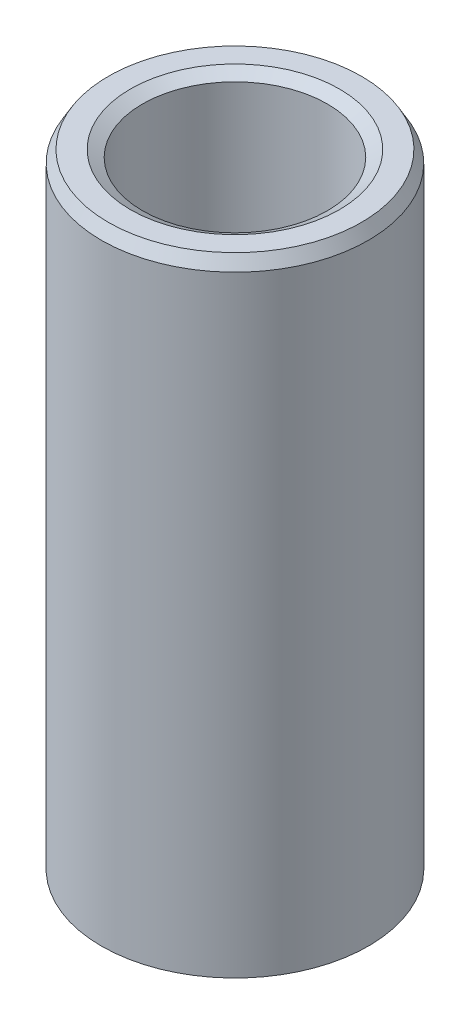
ISO-10303-21;
HEADER;
FILE_DESCRIPTION(('STEP AP214'),'2;1');
FILE_NAME('part.step','',(''),(''),'','','');
FILE_SCHEMA(('AUTOMOTIVE_DESIGN { 1 0 10303 214 1 1 1 1 }'));
ENDSEC;
DATA;
#1=APPLICATION_CONTEXT('core data for automotive mechanical design processes');
#2=APPLICATION_PROTOCOL_DEFINITION('international standard','automotive_design',2000,#1);
#3=PRODUCT_CONTEXT('',#1,'mechanical');
#4=PRODUCT('Part','Part','',(#3));
#5=PRODUCT_RELATED_PRODUCT_CATEGORY('part','',(#4));
#6=PRODUCT_DEFINITION_FORMATION('','',#4);
#7=PRODUCT_DEFINITION_CONTEXT('part definition',#1,'design');
#8=PRODUCT_DEFINITION('design','',#6,#7);
#9=PRODUCT_DEFINITION_SHAPE('','',#8);
#10=(LENGTH_UNIT() NAMED_UNIT(*) SI_UNIT(.MILLI.,.METRE.));
#11=(NAMED_UNIT(*) PLANE_ANGLE_UNIT() SI_UNIT($,.RADIAN.));
#12=(NAMED_UNIT(*) SI_UNIT($,.STERADIAN.) SOLID_ANGLE_UNIT());
#13=UNCERTAINTY_MEASURE_WITH_UNIT(LENGTH_MEASURE(1.E-05),#10,'distance_accuracy_value','');
#14=(GEOMETRIC_REPRESENTATION_CONTEXT(3) GLOBAL_UNCERTAINTY_ASSIGNED_CONTEXT((#13)) GLOBAL_UNIT_ASSIGNED_CONTEXT((#10,
#11,#12)) REPRESENTATION_CONTEXT('',''));
#15=CARTESIAN_POINT('',(0.,0.,0.));
#16=DIRECTION('',(0.,0.,1.));
#17=DIRECTION('',(1.,0.,0.));
#18=AXIS2_PLACEMENT_3D('',#15,#16,#17);
#19=CARTESIAN_POINT('',(0.,70.8002748482251,0.));
#20=DIRECTION('',(0.,-1.,0.));
#21=DIRECTION('',(0.,0.,-1.));
#22=AXIS2_PLACEMENT_3D('',#19,#20,#21);
#23=CYLINDRICAL_SURFACE('',#22,15.);
#24=CARTESIAN_POINT('',(0.,0.780929221135637,0.));
#25=DIRECTION('',(0.,1.,0.));
#26=DIRECTION('',(0.,0.,1.));
#27=AXIS2_PLACEMENT_3D('',#24,#25,#26);
#28=CIRCLE('',#27,15.);
#29=CARTESIAN_POINT('',(0.,0.780929221135637,15.));
#30=VERTEX_POINT('',#29);
#31=EDGE_CURVE('E10',#30,#30,#28,.T.);
#32=ORIENTED_EDGE('',*,*,#31,.T.);
#33=EDGE_LOOP('',(#32));
#34=FACE_BOUND('',#33,.T.);
#35=CARTESIAN_POINT('',(0.,69.447665760103,0.));
#36=DIRECTION('',(0.,1.,0.));
#37=DIRECTION('',(0.,0.,1.));
#38=AXIS2_PLACEMENT_3D('',#35,#36,#37);
#39=CIRCLE('',#38,15.);
#40=CARTESIAN_POINT('',(0.,69.447665760103,15.));
#41=VERTEX_POINT('',#40);
#42=EDGE_CURVE('E50',#41,#41,#39,.F.);
#43=ORIENTED_EDGE('',*,*,#42,.T.);
#44=EDGE_LOOP('',(#43));
#45=FACE_BOUND('',#44,.T.);
#46=ADVANCED_FACE('F39',(#34,#45),#23,.T.);
#47=CARTESIAN_POINT('',(0.,70.8002748482251,0.));
#48=DIRECTION('',(0.,1.,0.));
#49=DIRECTION('',(0.,0.,1.));
#50=AXIS2_PLACEMENT_3D('',#47,#48,#49);
#51=PLANE('',#50);
#52=CARTESIAN_POINT('',(0.,70.8002748482251,0.));
#53=DIRECTION('',(0.,1.,0.));
#54=DIRECTION('',(0.,0.,1.));
#55=AXIS2_PLACEMENT_3D('',#52,#53,#54);
#56=CIRCLE('',#55,11.743660745866);
#57=CARTESIAN_POINT('',(0.,70.8002748482251,11.743660745866));
#58=VERTEX_POINT('',#57);
#59=EDGE_CURVE('E58',#58,#58,#56,.F.);
#60=ORIENTED_EDGE('',*,*,#59,.T.);
#61=EDGE_LOOP('',(#60));
#62=FACE_BOUND('',#61,.T.);
#63=CARTESIAN_POINT('',(0.,70.8002748482251,0.));
#64=DIRECTION('',(0.,1.,0.));
#65=DIRECTION('',(0.,0.,1.));
#66=AXIS2_PLACEMENT_3D('',#63,#64,#65);
#67=CIRCLE('',#66,14.2190707788644);
#68=CARTESIAN_POINT('',(0.,70.8002748482251,14.2190707788644));
#69=VERTEX_POINT('',#68);
#70=EDGE_CURVE('E61',#69,#69,#67,.T.);
#71=ORIENTED_EDGE('',*,*,#70,.T.);
#72=EDGE_LOOP('',(#71));
#73=FACE_BOUND('',#72,.T.);
#74=ADVANCED_FACE('F88',(#62,#73),#51,.T.);
#75=CARTESIAN_POINT('',(0.,0.,0.));
#76=DIRECTION('',(0.,1.,0.));
#77=DIRECTION('',(0.,0.,1.));
#78=AXIS2_PLACEMENT_3D('',#75,#76,#77);
#79=PLANE('',#78);
#80=CARTESIAN_POINT('',(0.,0.,0.));
#81=DIRECTION('',(0.,1.,0.));
#82=DIRECTION('',(0.,0.,1.));
#83=AXIS2_PLACEMENT_3D('',#80,#81,#82);
#84=CIRCLE('',#83,11.1719808788795);
#85=CARTESIAN_POINT('',(0.,0.,11.1719808788795));
#86=VERTEX_POINT('',#85);
#87=EDGE_CURVE('E51',#86,#86,#84,.T.);
#88=ORIENTED_EDGE('',*,*,#87,.T.);
#89=EDGE_LOOP('',(#88));
#90=FACE_BOUND('',#89,.T.);
#91=CARTESIAN_POINT('',(0.,0.,0.));
#92=DIRECTION('',(0.,1.,0.));
#93=DIRECTION('',(0.,0.,1.));
#94=AXIS2_PLACEMENT_3D('',#91,#92,#93);
#95=CIRCLE('',#94,13.6473909118779);
#96=CARTESIAN_POINT('',(0.,0.,13.6473909118779));
#97=VERTEX_POINT('',#96);
#98=EDGE_CURVE('E54',#97,#97,#95,.F.);
#99=ORIENTED_EDGE('',*,*,#98,.T.);
#100=EDGE_LOOP('',(#99));
#101=FACE_BOUND('',#100,.T.);
#102=ADVANCED_FACE('F83',(#90,#101),#79,.F.);
#103=CARTESIAN_POINT('',(0.,70.8002748482251,0.));
#104=DIRECTION('',(0.,-1.,0.));
#105=DIRECTION('',(0.,0.,-1.));
#106=AXIS2_PLACEMENT_3D('',#103,#104,#105);
#107=CYLINDRICAL_SURFACE('',#106,10.3910516577439);
#108=CARTESIAN_POINT('',(0.,70.0193456270895,0.));
#109=DIRECTION('',(0.,1.,0.));
#110=DIRECTION('',(0.,0.,1.));
#111=AXIS2_PLACEMENT_3D('',#108,#109,#110);
#112=CIRCLE('',#111,10.3910516577439);
#113=CARTESIAN_POINT('',(0.,70.0193456270895,10.3910516577439));
#114=VERTEX_POINT('',#113);
#115=EDGE_CURVE('E67',#114,#114,#112,.T.);
#116=ORIENTED_EDGE('',*,*,#115,.T.);
#117=EDGE_LOOP('',(#116));
#118=FACE_BOUND('',#117,.T.);
#119=CARTESIAN_POINT('',(0.,1.35260908812211,0.));
#120=DIRECTION('',(0.,1.,0.));
#121=DIRECTION('',(0.,0.,1.));
#122=AXIS2_PLACEMENT_3D('',#119,#120,#121);
#123=CIRCLE('',#122,10.3910516577439);
#124=CARTESIAN_POINT('',(0.,1.35260908812211,10.3910516577439));
#125=VERTEX_POINT('',#124);
#126=EDGE_CURVE('E69',#125,#125,#123,.F.);
#127=ORIENTED_EDGE('',*,*,#126,.T.);
#128=EDGE_LOOP('',(#127));
#129=FACE_BOUND('',#128,.T.);
#130=ADVANCED_FACE('F71',(#118,#129),#107,.F.);
#131=CARTESIAN_POINT('',(0.,70.0193456270895,0.));
#132=DIRECTION('',(0.,1.,0.));
#133=DIRECTION('',(0.,0.,1.));
#134=AXIS2_PLACEMENT_3D('',#131,#132,#133);
#135=CONICAL_SURFACE('',#134,10.3910516577439,1.04719755119659);
#136=CARTESIAN_POINT('',(0.,70.8002748482251,11.743660745866));
#137=CARTESIAN_POINT('',(0.,70.7921401688383,11.7295710678647));
#138=CARTESIAN_POINT('',(0.,70.7840054894514,11.7154813898634));
#139=CARTESIAN_POINT('',(0.,70.7677361306778,11.6873020338609));
#140=CARTESIAN_POINT('',(0.,70.7596014512909,11.6732123558596));
#141=CARTESIAN_POINT('',(0.,70.7433320925173,11.6450329998571));
#142=CARTESIAN_POINT('',(0.,70.7351974131305,11.6309433218558));
#143=CARTESIAN_POINT('',(0.,70.7189280543568,11.6027639658533));
#144=CARTESIAN_POINT('',(0.,70.71079337497,11.588674287852));
#145=CARTESIAN_POINT('',(0.,70.6945240161963,11.5604949318494));
#146=CARTESIAN_POINT('',(0.,70.6863893368095,11.5464052538482));
#147=CARTESIAN_POINT('',(0.,70.6701199780358,11.5182258978456));
#148=CARTESIAN_POINT('',(0.,70.661985298649,11.5041362198443));
#149=CARTESIAN_POINT('',(0.,70.6457159398753,11.4759568638418));
#150=CARTESIAN_POINT('',(0.,70.6375812604885,11.4618671858405));
#151=CARTESIAN_POINT('',(0.,70.6213119017148,11.433687829838));
#152=CARTESIAN_POINT('',(0.,70.613177222328,11.4195981518367));
#153=CARTESIAN_POINT('',(0.,70.5969078635544,11.3914187958342));
#154=CARTESIAN_POINT('',(0.,70.5887731841675,11.3773291178329));
#155=CARTESIAN_POINT('',(0.,70.5725038253939,11.3491497618304));
#156=CARTESIAN_POINT('',(0.,70.5643691460071,11.3350600838291));
#157=CARTESIAN_POINT('',(0.,70.5480997872334,11.3068807278265));
#158=CARTESIAN_POINT('',(0.,70.5399651078466,11.2927910498253));
#159=CARTESIAN_POINT('',(0.,70.5236957490729,11.2646116938227));
#160=CARTESIAN_POINT('',(0.,70.5155610696861,11.2505220158215));
#161=CARTESIAN_POINT('',(0.,70.4992917109124,11.2223426598189));
#162=CARTESIAN_POINT('',(0.,70.4911570315256,11.2082529818176));
#163=CARTESIAN_POINT('',(0.,70.4748876727519,11.1800736258151));
#164=CARTESIAN_POINT('',(0.,70.4667529933651,11.1659839478138));
#165=CARTESIAN_POINT('',(0.,70.4504836345914,11.1378045918113));
#166=CARTESIAN_POINT('',(0.,70.4423489552046,11.12371491381));
#167=CARTESIAN_POINT('',(0.,70.426079596431,11.0955355578075));
#168=CARTESIAN_POINT('',(0.,70.4179449170441,11.0814458798062));
#169=CARTESIAN_POINT('',(0.,70.4016755582705,11.0532665238036));
#170=CARTESIAN_POINT('',(0.,70.3935408788836,11.0391768458024));
#171=CARTESIAN_POINT('',(0.,70.37727152011,11.0109974897998));
#172=CARTESIAN_POINT('',(0.,70.3691368407231,10.9969078117986));
#173=CARTESIAN_POINT('',(0.,70.3528674819495,10.968728455796));
#174=CARTESIAN_POINT('',(0.,70.3447328025626,10.9546387777947));
#175=CARTESIAN_POINT('',(0.,70.328463443789,10.9264594217922));
#176=CARTESIAN_POINT('',(0.,70.3203287644022,10.9123697437909));
#177=CARTESIAN_POINT('',(0.,70.3040594056285,10.8841903877884));
#178=CARTESIAN_POINT('',(0.,70.2959247262417,10.8701007097871));
#179=CARTESIAN_POINT('',(0.,70.279655367468,10.8419213537846));
#180=CARTESIAN_POINT('',(0.,70.2715206880812,10.8278316757833));
#181=CARTESIAN_POINT('',(0.,70.2552513293075,10.7996523197808));
#182=CARTESIAN_POINT('',(0.,70.2471166499207,10.7855626417795));
#183=CARTESIAN_POINT('',(0.,70.230847291147,10.7573832857769));
#184=CARTESIAN_POINT('',(0.,70.2227126117602,10.7432936077757));
#185=CARTESIAN_POINT('',(0.,70.2064432529865,10.7151142517731));
#186=CARTESIAN_POINT('',(0.,70.1983085735997,10.7010245737719));
#187=CARTESIAN_POINT('',(0.,70.1820392148261,10.6728452177693));
#188=CARTESIAN_POINT('',(0.,70.1739045354392,10.658755539768));
#189=CARTESIAN_POINT('',(0.,70.1576351766656,10.6305761837655));
#190=CARTESIAN_POINT('',(0.,70.1495004972787,10.6164865057642));
#191=CARTESIAN_POINT('',(0.,70.1332311385051,10.5883071497617));
#192=CARTESIAN_POINT('',(0.,70.1250964591183,10.5742174717604));
#193=CARTESIAN_POINT('',(0.,70.1088271003446,10.5460381157579));
#194=CARTESIAN_POINT('',(0.,70.1006924209578,10.5319484377566));
#195=CARTESIAN_POINT('',(0.,70.0844230621841,10.503769081754));
#196=CARTESIAN_POINT('',(0.,70.0762883827973,10.4896794037528));
#197=CARTESIAN_POINT('',(0.,70.0600190240236,10.4615000477502));
#198=CARTESIAN_POINT('',(0.,70.0518843446368,10.447410369749));
#199=CARTESIAN_POINT('',(0.,70.0356149858631,10.4192310137464));
#200=CARTESIAN_POINT('',(0.,70.0274803064763,10.4051413357451));
#201=CARTESIAN_POINT('',(0.,70.0193456270895,10.3910516577439));
#202=B_SPLINE_CURVE_WITH_KNOTS('',3,(#136,#137,#138,#139,#140,#141,#142,#143,#144,#145,#146,
#147,#148,#149,#150,#151,#152,#153,#154,#155,#156,#157,#158,#159,#160,#161,#162,#163,#164,#165,
#166,#167,#168,#169,#170,#171,#172,#173,#174,#175,#176,#177,#178,#179,#180,#181,#182,#183,#184,
#185,#186,#187,#188,#189,#190,#191,#192,#193,#194,#195,#196,#197,#198,#199,#200,#201),
.UNSPECIFIED.,.F.,.F.,(4,2,2,2,2,2,2,2,2,2,2,2,2,2,2,2,2,2,2,2,2,2,2,2,2,2,2,2,2,2,2,2,4),(0.,
0.0488080763209789,0.0976161526419594,0.146424228962931,0.195232305283912,0.244040381604884,
0.292848457925864,0.341656534246845,0.390464610567817,0.439272686888797,0.488080763209769,
0.536888839530749,0.58569691585173,0.634504992172702,0.683313068493682,0.732121144814654,
0.780929221135635,0.829737297456614,0.878545373777587,0.927353450098566,0.97616152641954,
1.02496960274052,1.0737776790615,1.12258575538247,1.17139383170345,1.22020190802442,
1.26900998434541,1.31781806066638,1.36662613698736,1.41543421330834,1.46424228962931,
1.51305036595029,1.56185844227126),.UNSPECIFIED.);
#203=EDGE_CURVE('BSEAM77',#58,#114,#202,.T.);
#204=ORIENTED_EDGE('',*,*,#59,.F.);
#205=ORIENTED_EDGE('',*,*,#115,.F.);
#206=ORIENTED_EDGE('',*,*,#203,.T.);
#207=ORIENTED_EDGE('',*,*,#203,.F.);
#208=EDGE_LOOP('',(#204,#206,#205,#207));
#209=FACE_BOUND('',#208,.T.);
#210=ADVANCED_FACE('F77',(#209),#135,.F.);
#211=CARTESIAN_POINT('',(0.,0.,0.));
#212=DIRECTION('',(0.,-1.,0.));
#213=DIRECTION('',(0.,0.,-1.));
#214=AXIS2_PLACEMENT_3D('',#211,#212,#213);
#215=CONICAL_SURFACE('',#214,11.1719808788795,0.523598775598292);
#216=ORIENTED_EDGE('',*,*,#126,.F.);
#217=EDGE_LOOP('',(#216));
#218=FACE_BOUND('',#217,.T.);
#219=ORIENTED_EDGE('',*,*,#87,.F.);
#220=EDGE_LOOP('',(#219));
#221=FACE_BOUND('',#220,.T.);
#222=ADVANCED_FACE('F73',(#218,#221),#215,.F.);
#223=CARTESIAN_POINT('',(0.,0.780929221135637,0.));
#224=DIRECTION('',(0.,1.,0.));
#225=DIRECTION('',(0.,0.,1.));
#226=AXIS2_PLACEMENT_3D('',#223,#224,#225);
#227=CONICAL_SURFACE('',#226,15.,1.0471975511966);
#228=CARTESIAN_POINT('',(0.,0.,13.6473909118779));
#229=CARTESIAN_POINT('',(0.,0.00813467938683021,13.6614805898792));
#230=CARTESIAN_POINT('',(0.,0.0162693587736595,13.6755702678804));
#231=CARTESIAN_POINT('',(0.,0.0325387175473181,13.703749623883));
#232=CARTESIAN_POINT('',(0.,0.0406733969341474,13.7178393018842));
#233=CARTESIAN_POINT('',(0.,0.0569427557078065,13.7460186578868));
#234=CARTESIAN_POINT('',(0.,0.0650774350946364,13.7601083358881));
#235=CARTESIAN_POINT('',(0.,0.0813467938682956,13.7882876918906));
#236=CARTESIAN_POINT('',(0.,0.089481473255125,13.8023773698919));
#237=CARTESIAN_POINT('',(0.,0.105750832028784,13.8305567258944));
#238=CARTESIAN_POINT('',(0.,0.113885511415614,13.8446464038957));
#239=CARTESIAN_POINT('',(0.,0.130154870189273,13.8728257598982));
#240=CARTESIAN_POINT('',(0.,0.138289549576102,13.8869154378995));
#241=CARTESIAN_POINT('',(0.,0.154558908349761,13.915094793902));
#242=CARTESIAN_POINT('',(0.,0.162693587736591,13.9291844719033));
#243=CARTESIAN_POINT('',(0.,0.17896294651025,13.9573638279059));
#244=CARTESIAN_POINT('',(0.,0.18709762589708,13.9714535059071));
#245=CARTESIAN_POINT('',(0.,0.203366984670739,13.9996328619097));
#246=CARTESIAN_POINT('',(0.,0.211501664057568,14.013722539911));
#247=CARTESIAN_POINT('',(0.,0.227771022831227,14.0419018959135));
#248=CARTESIAN_POINT('',(0.,0.235905702218057,14.0559915739148));
#249=CARTESIAN_POINT('',(0.,0.252175060991716,14.0841709299173));
#250=CARTESIAN_POINT('',(0.,0.260309740378546,14.0982606079186));
#251=CARTESIAN_POINT('',(0.,0.276579099152205,14.1264399639211));
#252=CARTESIAN_POINT('',(0.,0.284713778539034,14.1405296419224));
#253=CARTESIAN_POINT('',(0.,0.300983137312693,14.1687089979249));
#254=CARTESIAN_POINT('',(0.,0.309117816699523,14.1827986759262));
#255=CARTESIAN_POINT('',(0.,0.325387175473182,14.2109780319288));
#256=CARTESIAN_POINT('',(0.,0.333521854860012,14.22506770993));
#257=CARTESIAN_POINT('',(0.,0.349791213633671,14.2532470659326));
#258=CARTESIAN_POINT('',(0.,0.3579258930205,14.2673367439339));
#259=CARTESIAN_POINT('',(0.,0.374195251794159,14.2955160999364));
#260=CARTESIAN_POINT('',(0.,0.382329931180989,14.3096057779377));
#261=CARTESIAN_POINT('',(0.,0.398599289954648,14.3377851339402));
#262=CARTESIAN_POINT('',(0.,0.406733969341478,14.3518748119415));
#263=CARTESIAN_POINT('',(0.,0.423003328115137,14.380054167944));
#264=CARTESIAN_POINT('',(0.,0.431138007501966,14.3941438459453));
#265=CARTESIAN_POINT('',(0.,0.447407366275625,14.4223232019478));
#266=CARTESIAN_POINT('',(0.,0.455542045662455,14.4364128799491));
#267=CARTESIAN_POINT('',(0.,0.471811404436114,14.4645922359517));
#268=CARTESIAN_POINT('',(0.,0.479946083822944,14.4786819139529));
#269=CARTESIAN_POINT('',(0.,0.496215442596603,14.5068612699555));
#270=CARTESIAN_POINT('',(0.,0.504350121983432,14.5209509479567));
#271=CARTESIAN_POINT('',(0.,0.520619480757092,14.5491303039593));
#272=CARTESIAN_POINT('',(0.,0.528754160143921,14.5632199819606));
#273=CARTESIAN_POINT('',(0.,0.54502351891758,14.5913993379631));
#274=CARTESIAN_POINT('',(0.,0.55315819830441,14.6054890159644));
#275=CARTESIAN_POINT('',(0.,0.569427557078069,14.6336683719669));
#276=CARTESIAN_POINT('',(0.,0.577562236464898,14.6477580499682));
#277=CARTESIAN_POINT('',(0.,0.593831595238558,14.6759374059707));
#278=CARTESIAN_POINT('',(0.,0.601966274625387,14.690027083972));
#279=CARTESIAN_POINT('',(0.,0.618235633399046,14.7182064399746));
#280=CARTESIAN_POINT('',(0.,0.626370312785876,14.7322961179758));
#281=CARTESIAN_POINT('',(0.,0.642639671559535,14.7604754739784));
#282=CARTESIAN_POINT('',(0.,0.650774350946364,14.7745651519796));
#283=CARTESIAN_POINT('',(0.,0.667043709720023,14.8027445079822));
#284=CARTESIAN_POINT('',(0.,0.675178389106853,14.8168341859835));
#285=CARTESIAN_POINT('',(0.,0.691447747880512,14.845013541986));
#286=CARTESIAN_POINT('',(0.,0.699582427267342,14.8591032199873));
#287=CARTESIAN_POINT('',(0.,0.715851786041001,14.8872825759898));
#288=CARTESIAN_POINT('',(0.,0.72398646542783,14.9013722539911));
#289=CARTESIAN_POINT('',(0.,0.740255824201489,14.9295516099936));
#290=CARTESIAN_POINT('',(0.,0.748390503588319,14.9436412879949));
#291=CARTESIAN_POINT('',(0.,0.764659862361978,14.9718206439975));
#292=CARTESIAN_POINT('',(0.,0.772794541748808,14.9859103219987));
#293=CARTESIAN_POINT('',(0.,0.780929221135637,15.));
#294=B_SPLINE_CURVE_WITH_KNOTS('',3,(#228,#229,#230,#231,#232,#233,#234,#235,#236,#237,#238,
#239,#240,#241,#242,#243,#244,#245,#246,#247,#248,#249,#250,#251,#252,#253,#254,#255,#256,#257,
#258,#259,#260,#261,#262,#263,#264,#265,#266,#267,#268,#269,#270,#271,#272,#273,#274,#275,#276,
#277,#278,#279,#280,#281,#282,#283,#284,#285,#286,#287,#288,#289,#290,#291,#292,#293),
.UNSPECIFIED.,.F.,.F.,(4,2,2,2,2,2,2,2,2,2,2,2,2,2,2,2,2,2,2,2,2,2,2,2,2,2,2,2,2,2,2,2,4),(0.,
0.0488080763209761,0.0976161526419552,0.146424228962931,0.195232305283909,0.244040381604887,
0.292848457925864,0.341656534246842,0.390464610567819,0.439272686888797,0.488080763209773,
0.536888839530751,0.585696915851728,0.634504992172706,0.683313068493684,0.732121144814661,
0.780929221135639,0.829737297456617,0.878545373777594,0.92735345009857,0.976161526419548,
1.02496960274053,1.0737776790615,1.12258575538248,1.17139383170346,1.22020190802444,
1.26900998434541,1.31781806066639,1.36662613698737,1.41543421330834,1.46424228962932,
1.5130503659503,1.56185844227128),.UNSPECIFIED.);
#295=EDGE_CURVE('BSEAM76',#97,#30,#294,.T.);
#296=ORIENTED_EDGE('',*,*,#98,.F.);
#297=ORIENTED_EDGE('',*,*,#31,.F.);
#298=ORIENTED_EDGE('',*,*,#295,.T.);
#299=ORIENTED_EDGE('',*,*,#295,.F.);
#300=EDGE_LOOP('',(#296,#298,#297,#299));
#301=FACE_BOUND('',#300,.T.);
#302=ADVANCED_FACE('F76',(#301),#227,.T.);
#303=CARTESIAN_POINT('',(0.,70.8002748482251,0.));
#304=DIRECTION('',(0.,-1.,0.));
#305=DIRECTION('',(0.,0.,-1.));
#306=AXIS2_PLACEMENT_3D('',#303,#304,#305);
#307=CONICAL_SURFACE('',#306,14.2190707788644,0.523598775598295);
#308=ORIENTED_EDGE('',*,*,#42,.F.);
#309=EDGE_LOOP('',(#308));
#310=FACE_BOUND('',#309,.T.);
#311=ORIENTED_EDGE('',*,*,#70,.F.);
#312=EDGE_LOOP('',(#311));
#313=FACE_BOUND('',#312,.T.);
#314=ADVANCED_FACE('F45',(#310,#313),#307,.T.);
#315=CLOSED_SHELL('',(#46,#74,#102,#130,#210,#222,#302,#314));
#316=MANIFOLD_SOLID_BREP('B2',#315);
#317=ADVANCED_BREP_SHAPE_REPRESENTATION('',(#18,#316),#14);
#318=SHAPE_DEFINITION_REPRESENTATION(#9,#317);
ENDSEC;
END-ISO-10303-21;
